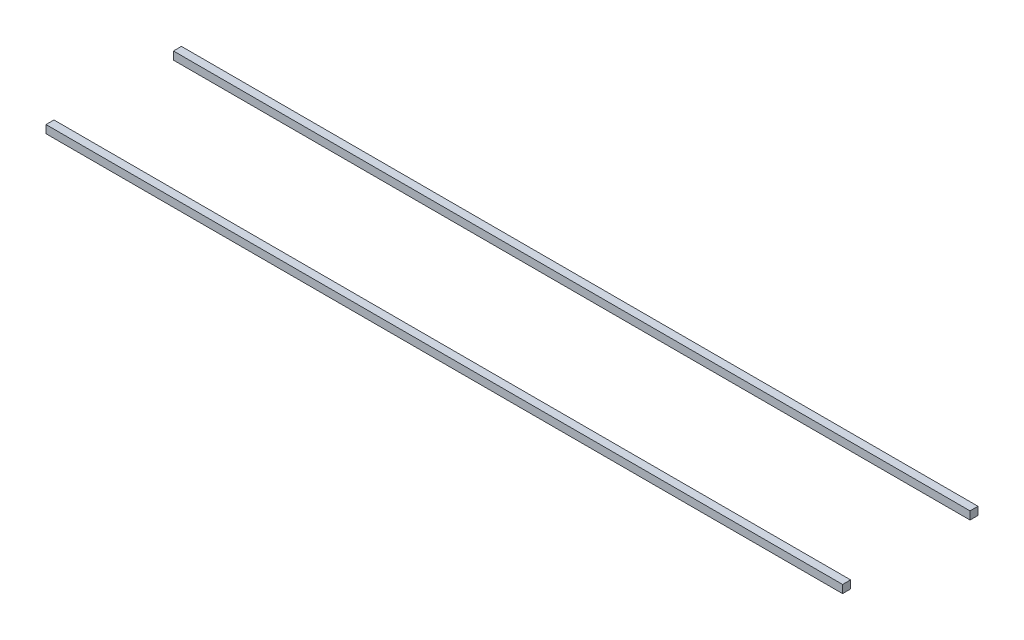
ISO-10303-21;
HEADER;
FILE_DESCRIPTION(('STEP AP214'),'2;1');
FILE_NAME('part.step','',(''),(''),'','','');
FILE_SCHEMA(('AUTOMOTIVE_DESIGN { 1 0 10303 214 1 1 1 1 }'));
ENDSEC;
DATA;
#1=APPLICATION_CONTEXT('core data for automotive mechanical design processes');
#2=APPLICATION_PROTOCOL_DEFINITION('international standard','automotive_design',2000,#1);
#3=PRODUCT_CONTEXT('',#1,'mechanical');
#4=PRODUCT('Part','Part','',(#3));
#5=PRODUCT_RELATED_PRODUCT_CATEGORY('part','',(#4));
#6=PRODUCT_DEFINITION_FORMATION('','',#4);
#7=PRODUCT_DEFINITION_CONTEXT('part definition',#1,'design');
#8=PRODUCT_DEFINITION('design','',#6,#7);
#9=PRODUCT_DEFINITION_SHAPE('','',#8);
#10=(LENGTH_UNIT() NAMED_UNIT(*) SI_UNIT(.MILLI.,.METRE.));
#11=(NAMED_UNIT(*) PLANE_ANGLE_UNIT() SI_UNIT($,.RADIAN.));
#12=(NAMED_UNIT(*) SI_UNIT($,.STERADIAN.) SOLID_ANGLE_UNIT());
#13=UNCERTAINTY_MEASURE_WITH_UNIT(LENGTH_MEASURE(1.E-05),#10,'distance_accuracy_value','');
#14=(GEOMETRIC_REPRESENTATION_CONTEXT(3) GLOBAL_UNCERTAINTY_ASSIGNED_CONTEXT((#13)) GLOBAL_UNIT_ASSIGNED_CONTEXT((#10,
#11,#12)) REPRESENTATION_CONTEXT('',''));
#15=CARTESIAN_POINT('',(0.,0.,0.));
#16=DIRECTION('',(0.,0.,1.));
#17=DIRECTION('',(1.,0.,0.));
#18=AXIS2_PLACEMENT_3D('',#15,#16,#17);
#19=CARTESIAN_POINT('',(4000.,-20.,300.));
#20=DIRECTION('',(0.,0.,1.));
#21=DIRECTION('',(0.,-1.,0.));
#22=AXIS2_PLACEMENT_3D('',#19,#20,#21);
#23=PLANE('',#22);
#24=DIRECTION('',(0.,1.,0.));
#25=VECTOR('',#24,1.);
#26=CARTESIAN_POINT('',(0.,-20.,300.));
#27=LINE('',#26,#25);
#28=CARTESIAN_POINT('',(0.,-20.,300.));
#29=VERTEX_POINT('',#28);
#30=CARTESIAN_POINT('',(0.,20.,300.));
#31=VERTEX_POINT('',#30);
#32=EDGE_CURVE('E108',#29,#31,#27,.T.);
#33=ORIENTED_EDGE('',*,*,#32,.T.);
#34=DIRECTION('',(-1.,0.,0.));
#35=VECTOR('',#34,1.);
#36=CARTESIAN_POINT('',(4000.,20.,300.));
#37=LINE('',#36,#35);
#38=CARTESIAN_POINT('',(4000.,20.,300.));
#39=VERTEX_POINT('',#38);
#40=EDGE_CURVE('E12',#39,#31,#37,.T.);
#41=ORIENTED_EDGE('',*,*,#40,.F.);
#42=DIRECTION('',(0.,1.,0.));
#43=VECTOR('',#42,1.);
#44=CARTESIAN_POINT('',(4000.,-20.,300.));
#45=LINE('',#44,#43);
#46=CARTESIAN_POINT('',(4000.,-20.,300.));
#47=VERTEX_POINT('',#46);
#48=EDGE_CURVE('E96',#47,#39,#45,.T.);
#49=ORIENTED_EDGE('',*,*,#48,.F.);
#50=DIRECTION('',(-1.,0.,0.));
#51=VECTOR('',#50,1.);
#52=CARTESIAN_POINT('',(4000.,-20.,300.));
#53=LINE('',#52,#51);
#54=EDGE_CURVE('E104',#47,#29,#53,.T.);
#55=ORIENTED_EDGE('',*,*,#54,.T.);
#56=EDGE_LOOP('',(#33,#41,#49,#55));
#57=FACE_BOUND('',#56,.T.);
#58=ADVANCED_FACE('F45',(#57),#23,.F.);
#59=CARTESIAN_POINT('',(4000.,20.,300.));
#60=DIRECTION('',(0.,-1.,0.));
#61=DIRECTION('',(0.,0.,-1.));
#62=AXIS2_PLACEMENT_3D('',#59,#60,#61);
#63=PLANE('',#62);
#64=DIRECTION('',(0.,0.,1.));
#65=VECTOR('',#64,1.);
#66=CARTESIAN_POINT('',(0.,20.,300.));
#67=LINE('',#66,#65);
#68=CARTESIAN_POINT('',(0.,20.,340.));
#69=VERTEX_POINT('',#68);
#70=EDGE_CURVE('E100',#31,#69,#67,.T.);
#71=ORIENTED_EDGE('',*,*,#70,.T.);
#72=DIRECTION('',(-1.,0.,0.));
#73=VECTOR('',#72,1.);
#74=CARTESIAN_POINT('',(4000.,20.,340.));
#75=LINE('',#74,#73);
#76=CARTESIAN_POINT('',(4000.,20.,340.));
#77=VERTEX_POINT('',#76);
#78=EDGE_CURVE('E53',#77,#69,#75,.T.);
#79=ORIENTED_EDGE('',*,*,#78,.F.);
#80=DIRECTION('',(0.,0.,1.));
#81=VECTOR('',#80,1.);
#82=CARTESIAN_POINT('',(4000.,20.,300.));
#83=LINE('',#82,#81);
#84=EDGE_CURVE('E91',#39,#77,#83,.T.);
#85=ORIENTED_EDGE('',*,*,#84,.F.);
#86=ORIENTED_EDGE('',*,*,#40,.T.);
#87=EDGE_LOOP('',(#71,#79,#85,#86));
#88=FACE_BOUND('',#87,.T.);
#89=ADVANCED_FACE('F99',(#88),#63,.F.);
#90=CARTESIAN_POINT('',(4000.,-20.,340.));
#91=DIRECTION('',(0.,0.,-1.));
#92=DIRECTION('',(-1.,0.,0.));
#93=AXIS2_PLACEMENT_3D('',#90,#91,#92);
#94=PLANE('',#93);
#95=DIRECTION('',(0.,-1.,0.));
#96=VECTOR('',#95,1.);
#97=CARTESIAN_POINT('',(0.,-20.,340.));
#98=LINE('',#97,#96);
#99=CARTESIAN_POINT('',(0.,-20.,340.));
#100=VERTEX_POINT('',#99);
#101=EDGE_CURVE('E78',#69,#100,#98,.T.);
#102=ORIENTED_EDGE('',*,*,#101,.T.);
#103=DIRECTION('',(-1.,0.,0.));
#104=VECTOR('',#103,1.);
#105=CARTESIAN_POINT('',(4000.,-20.,340.));
#106=LINE('',#105,#104);
#107=CARTESIAN_POINT('',(4000.,-20.,340.));
#108=VERTEX_POINT('',#107);
#109=EDGE_CURVE('E101',#108,#100,#106,.T.);
#110=ORIENTED_EDGE('',*,*,#109,.F.);
#111=DIRECTION('',(0.,-1.,0.));
#112=VECTOR('',#111,1.);
#113=CARTESIAN_POINT('',(4000.,-20.,340.));
#114=LINE('',#113,#112);
#115=EDGE_CURVE('E94',#77,#108,#114,.T.);
#116=ORIENTED_EDGE('',*,*,#115,.F.);
#117=ORIENTED_EDGE('',*,*,#78,.T.);
#118=EDGE_LOOP('',(#102,#110,#116,#117));
#119=FACE_BOUND('',#118,.T.);
#120=ADVANCED_FACE('F102',(#119),#94,.F.);
#121=CARTESIAN_POINT('',(4000.,-20.,300.));
#122=DIRECTION('',(0.,1.,0.));
#123=DIRECTION('',(0.,0.,1.));
#124=AXIS2_PLACEMENT_3D('',#121,#122,#123);
#125=PLANE('',#124);
#126=DIRECTION('',(0.,0.,-1.));
#127=VECTOR('',#126,1.);
#128=CARTESIAN_POINT('',(0.,-20.,300.));
#129=LINE('',#128,#127);
#130=EDGE_CURVE('E84',#100,#29,#129,.T.);
#131=ORIENTED_EDGE('',*,*,#130,.T.);
#132=ORIENTED_EDGE('',*,*,#54,.F.);
#133=DIRECTION('',(0.,0.,-1.));
#134=VECTOR('',#133,1.);
#135=CARTESIAN_POINT('',(4000.,-20.,300.));
#136=LINE('',#135,#134);
#137=EDGE_CURVE('E61',#108,#47,#136,.T.);
#138=ORIENTED_EDGE('',*,*,#137,.F.);
#139=ORIENTED_EDGE('',*,*,#109,.T.);
#140=EDGE_LOOP('',(#131,#132,#138,#139));
#141=FACE_BOUND('',#140,.T.);
#142=ADVANCED_FACE('F115',(#141),#125,.F.);
#143=CARTESIAN_POINT('',(4000.,0.,0.));
#144=DIRECTION('',(1.,0.,0.));
#145=DIRECTION('',(0.,0.,-1.));
#146=AXIS2_PLACEMENT_3D('',#143,#144,#145);
#147=PLANE('',#146);
#148=ORIENTED_EDGE('',*,*,#48,.T.);
#149=ORIENTED_EDGE('',*,*,#84,.T.);
#150=ORIENTED_EDGE('',*,*,#115,.T.);
#151=ORIENTED_EDGE('',*,*,#137,.T.);
#152=EDGE_LOOP('',(#148,#149,#150,#151));
#153=FACE_BOUND('',#152,.T.);
#154=ADVANCED_FACE('F92',(#153),#147,.T.);
#155=CARTESIAN_POINT('',(0.,0.,0.));
#156=DIRECTION('',(1.,0.,0.));
#157=DIRECTION('',(0.,0.,-1.));
#158=AXIS2_PLACEMENT_3D('',#155,#156,#157);
#159=PLANE('',#158);
#160=ORIENTED_EDGE('',*,*,#32,.F.);
#161=ORIENTED_EDGE('',*,*,#130,.F.);
#162=ORIENTED_EDGE('',*,*,#101,.F.);
#163=ORIENTED_EDGE('',*,*,#70,.F.);
#164=EDGE_LOOP('',(#160,#161,#162,#163));
#165=FACE_BOUND('',#164,.T.);
#166=ADVANCED_FACE('F118',(#165),#159,.F.);
#167=CLOSED_SHELL('',(#58,#89,#120,#142,#154,#166));
#168=MANIFOLD_SOLID_BREP('B2',#167);
#169=CARTESIAN_POINT('',(4000.,-20.,-340.));
#170=DIRECTION('',(0.,0.,1.));
#171=DIRECTION('',(1.,0.,0.));
#172=AXIS2_PLACEMENT_3D('',#169,#170,#171);
#173=PLANE('',#172);
#174=DIRECTION('',(0.,1.,0.));
#175=VECTOR('',#174,1.);
#176=CARTESIAN_POINT('',(0.,-20.,-340.));
#177=LINE('',#176,#175);
#178=CARTESIAN_POINT('',(0.,-20.,-340.));
#179=VERTEX_POINT('',#178);
#180=CARTESIAN_POINT('',(0.,20.,-340.));
#181=VERTEX_POINT('',#180);
#182=EDGE_CURVE('E232',#179,#181,#177,.T.);
#183=ORIENTED_EDGE('',*,*,#182,.T.);
#184=DIRECTION('',(-1.,0.,0.));
#185=VECTOR('',#184,1.);
#186=CARTESIAN_POINT('',(4000.,20.,-340.));
#187=LINE('',#186,#185);
#188=CARTESIAN_POINT('',(4000.,20.,-340.));
#189=VERTEX_POINT('',#188);
#190=EDGE_CURVE('E43',#189,#181,#187,.T.);
#191=ORIENTED_EDGE('',*,*,#190,.F.);
#192=DIRECTION('',(0.,1.,0.));
#193=VECTOR('',#192,1.);
#194=CARTESIAN_POINT('',(4000.,-20.,-340.));
#195=LINE('',#194,#193);
#196=CARTESIAN_POINT('',(4000.,-20.,-340.));
#197=VERTEX_POINT('',#196);
#198=EDGE_CURVE('E220',#197,#189,#195,.T.);
#199=ORIENTED_EDGE('',*,*,#198,.F.);
#200=DIRECTION('',(-1.,0.,0.));
#201=VECTOR('',#200,1.);
#202=CARTESIAN_POINT('',(4000.,-20.,-340.));
#203=LINE('',#202,#201);
#204=EDGE_CURVE('E228',#197,#179,#203,.T.);
#205=ORIENTED_EDGE('',*,*,#204,.T.);
#206=EDGE_LOOP('',(#183,#191,#199,#205));
#207=FACE_BOUND('',#206,.T.);
#208=ADVANCED_FACE('F169',(#207),#173,.F.);
#209=CARTESIAN_POINT('',(4000.,20.,-300.));
#210=DIRECTION('',(0.,-1.,0.));
#211=DIRECTION('',(0.,0.,-1.));
#212=AXIS2_PLACEMENT_3D('',#209,#210,#211);
#213=PLANE('',#212);
#214=DIRECTION('',(0.,0.,1.));
#215=VECTOR('',#214,1.);
#216=CARTESIAN_POINT('',(0.,20.,-300.));
#217=LINE('',#216,#215);
#218=CARTESIAN_POINT('',(0.,20.,-300.));
#219=VERTEX_POINT('',#218);
#220=EDGE_CURVE('E224',#181,#219,#217,.T.);
#221=ORIENTED_EDGE('',*,*,#220,.T.);
#222=DIRECTION('',(-1.,0.,0.));
#223=VECTOR('',#222,1.);
#224=CARTESIAN_POINT('',(4000.,20.,-300.));
#225=LINE('',#224,#223);
#226=CARTESIAN_POINT('',(4000.,20.,-300.));
#227=VERTEX_POINT('',#226);
#228=EDGE_CURVE('E177',#227,#219,#225,.T.);
#229=ORIENTED_EDGE('',*,*,#228,.F.);
#230=DIRECTION('',(0.,0.,1.));
#231=VECTOR('',#230,1.);
#232=CARTESIAN_POINT('',(4000.,20.,-300.));
#233=LINE('',#232,#231);
#234=EDGE_CURVE('E215',#189,#227,#233,.T.);
#235=ORIENTED_EDGE('',*,*,#234,.F.);
#236=ORIENTED_EDGE('',*,*,#190,.T.);
#237=EDGE_LOOP('',(#221,#229,#235,#236));
#238=FACE_BOUND('',#237,.T.);
#239=ADVANCED_FACE('F223',(#238),#213,.F.);
#240=CARTESIAN_POINT('',(4000.,-20.,-300.));
#241=DIRECTION('',(0.,0.,-1.));
#242=DIRECTION('',(0.,1.,0.));
#243=AXIS2_PLACEMENT_3D('',#240,#241,#242);
#244=PLANE('',#243);
#245=DIRECTION('',(0.,-1.,0.));
#246=VECTOR('',#245,1.);
#247=CARTESIAN_POINT('',(0.,-20.,-300.));
#248=LINE('',#247,#246);
#249=CARTESIAN_POINT('',(0.,-20.,-300.));
#250=VERTEX_POINT('',#249);
#251=EDGE_CURVE('E202',#219,#250,#248,.T.);
#252=ORIENTED_EDGE('',*,*,#251,.T.);
#253=DIRECTION('',(-1.,0.,0.));
#254=VECTOR('',#253,1.);
#255=CARTESIAN_POINT('',(4000.,-20.,-300.));
#256=LINE('',#255,#254);
#257=CARTESIAN_POINT('',(4000.,-20.,-300.));
#258=VERTEX_POINT('',#257);
#259=EDGE_CURVE('E225',#258,#250,#256,.T.);
#260=ORIENTED_EDGE('',*,*,#259,.F.);
#261=DIRECTION('',(0.,-1.,0.));
#262=VECTOR('',#261,1.);
#263=CARTESIAN_POINT('',(4000.,-20.,-300.));
#264=LINE('',#263,#262);
#265=EDGE_CURVE('E218',#227,#258,#264,.T.);
#266=ORIENTED_EDGE('',*,*,#265,.F.);
#267=ORIENTED_EDGE('',*,*,#228,.T.);
#268=EDGE_LOOP('',(#252,#260,#266,#267));
#269=FACE_BOUND('',#268,.T.);
#270=ADVANCED_FACE('F226',(#269),#244,.F.);
#271=CARTESIAN_POINT('',(4000.,-20.,-300.));
#272=DIRECTION('',(0.,1.,0.));
#273=DIRECTION('',(0.,0.,1.));
#274=AXIS2_PLACEMENT_3D('',#271,#272,#273);
#275=PLANE('',#274);
#276=DIRECTION('',(0.,0.,-1.));
#277=VECTOR('',#276,1.);
#278=CARTESIAN_POINT('',(0.,-20.,-300.));
#279=LINE('',#278,#277);
#280=EDGE_CURVE('E208',#250,#179,#279,.T.);
#281=ORIENTED_EDGE('',*,*,#280,.T.);
#282=ORIENTED_EDGE('',*,*,#204,.F.);
#283=DIRECTION('',(0.,0.,-1.));
#284=VECTOR('',#283,1.);
#285=CARTESIAN_POINT('',(4000.,-20.,-300.));
#286=LINE('',#285,#284);
#287=EDGE_CURVE('E185',#258,#197,#286,.T.);
#288=ORIENTED_EDGE('',*,*,#287,.F.);
#289=ORIENTED_EDGE('',*,*,#259,.T.);
#290=EDGE_LOOP('',(#281,#282,#288,#289));
#291=FACE_BOUND('',#290,.T.);
#292=ADVANCED_FACE('F239',(#291),#275,.F.);
#293=CARTESIAN_POINT('',(4000.,0.,0.));
#294=DIRECTION('',(-1.,0.,0.));
#295=DIRECTION('',(0.,0.,1.));
#296=AXIS2_PLACEMENT_3D('',#293,#294,#295);
#297=PLANE('',#296);
#298=ORIENTED_EDGE('',*,*,#198,.T.);
#299=ORIENTED_EDGE('',*,*,#234,.T.);
#300=ORIENTED_EDGE('',*,*,#265,.T.);
#301=ORIENTED_EDGE('',*,*,#287,.T.);
#302=EDGE_LOOP('',(#298,#299,#300,#301));
#303=FACE_BOUND('',#302,.T.);
#304=ADVANCED_FACE('F216',(#303),#297,.F.);
#305=CARTESIAN_POINT('',(0.,0.,0.));
#306=DIRECTION('',(-1.,0.,0.));
#307=DIRECTION('',(0.,0.,1.));
#308=AXIS2_PLACEMENT_3D('',#305,#306,#307);
#309=PLANE('',#308);
#310=ORIENTED_EDGE('',*,*,#182,.F.);
#311=ORIENTED_EDGE('',*,*,#280,.F.);
#312=ORIENTED_EDGE('',*,*,#251,.F.);
#313=ORIENTED_EDGE('',*,*,#220,.F.);
#314=EDGE_LOOP('',(#310,#311,#312,#313));
#315=FACE_BOUND('',#314,.T.);
#316=ADVANCED_FACE('F242',(#315),#309,.T.);
#317=CLOSED_SHELL('',(#208,#239,#270,#292,#304,#316));
#318=MANIFOLD_SOLID_BREP('B6',#317);
#319=ADVANCED_BREP_SHAPE_REPRESENTATION('',(#18,#168,#318),#14);
#320=SHAPE_DEFINITION_REPRESENTATION(#9,#319);
ENDSEC;
END-ISO-10303-21;
